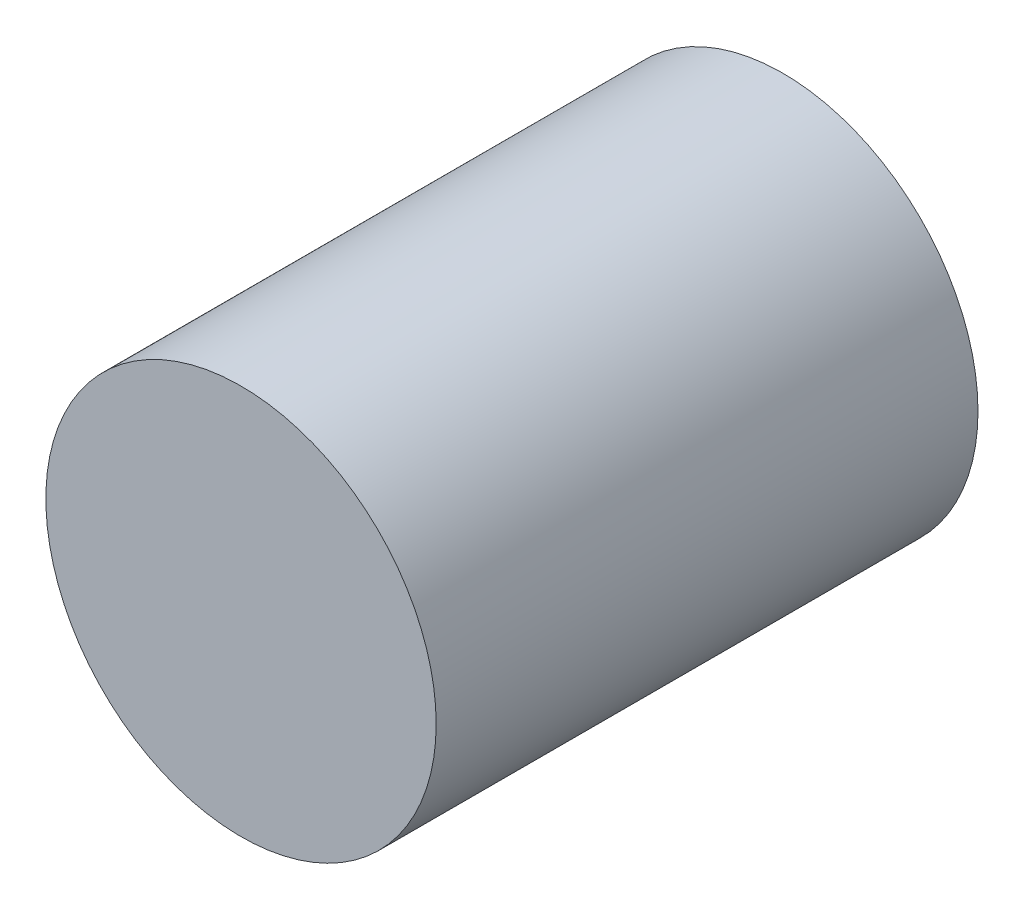
ISO-10303-21;
HEADER;
FILE_DESCRIPTION(('STEP AP214'),'2;1');
FILE_NAME('part.step','',(''),(''),'','','');
FILE_SCHEMA(('AUTOMOTIVE_DESIGN { 1 0 10303 214 1 1 1 1 }'));
ENDSEC;
DATA;
#1=APPLICATION_CONTEXT('core data for automotive mechanical design processes');
#2=APPLICATION_PROTOCOL_DEFINITION('international standard','automotive_design',2000,#1);
#3=PRODUCT_CONTEXT('',#1,'mechanical');
#4=PRODUCT('Part','Part','',(#3));
#5=PRODUCT_RELATED_PRODUCT_CATEGORY('part','',(#4));
#6=PRODUCT_DEFINITION_FORMATION('','',#4);
#7=PRODUCT_DEFINITION_CONTEXT('part definition',#1,'design');
#8=PRODUCT_DEFINITION('design','',#6,#7);
#9=PRODUCT_DEFINITION_SHAPE('','',#8);
#10=(LENGTH_UNIT() NAMED_UNIT(*) SI_UNIT(.MILLI.,.METRE.));
#11=(NAMED_UNIT(*) PLANE_ANGLE_UNIT() SI_UNIT($,.RADIAN.));
#12=(NAMED_UNIT(*) SI_UNIT($,.STERADIAN.) SOLID_ANGLE_UNIT());
#13=UNCERTAINTY_MEASURE_WITH_UNIT(LENGTH_MEASURE(1.E-05),#10,'distance_accuracy_value','');
#14=(GEOMETRIC_REPRESENTATION_CONTEXT(3) GLOBAL_UNCERTAINTY_ASSIGNED_CONTEXT((#13)) GLOBAL_UNIT_ASSIGNED_CONTEXT((#10,
#11,#12)) REPRESENTATION_CONTEXT('',''));
#15=CARTESIAN_POINT('',(0.,0.,0.));
#16=DIRECTION('',(0.,0.,1.));
#17=DIRECTION('',(1.,0.,0.));
#18=AXIS2_PLACEMENT_3D('',#15,#16,#17);
#19=CARTESIAN_POINT('',(0.,0.,52.75));
#20=DIRECTION('',(0.,0.,-1.));
#21=DIRECTION('',(-1.,0.,0.));
#22=AXIS2_PLACEMENT_3D('',#19,#20,#21);
#23=CYLINDRICAL_SURFACE('',#22,19.);
#24=CARTESIAN_POINT('',(0.,0.,52.75));
#25=DIRECTION('',(0.,0.,1.));
#26=DIRECTION('',(1.,0.,0.));
#27=AXIS2_PLACEMENT_3D('',#24,#25,#26);
#28=CIRCLE('',#27,19.);
#29=CARTESIAN_POINT('',(19.,0.,52.75));
#30=VERTEX_POINT('',#29);
#31=EDGE_CURVE('E10',#30,#30,#28,.T.);
#32=ORIENTED_EDGE('',*,*,#31,.F.);
#33=EDGE_LOOP('',(#32));
#34=FACE_BOUND('',#33,.T.);
#35=CARTESIAN_POINT('',(0.,0.,0.));
#36=DIRECTION('',(0.,0.,1.));
#37=DIRECTION('',(1.,0.,0.));
#38=AXIS2_PLACEMENT_3D('',#35,#36,#37);
#39=CIRCLE('',#38,19.);
#40=CARTESIAN_POINT('',(19.,0.,0.));
#41=VERTEX_POINT('',#40);
#42=EDGE_CURVE('E36',#41,#41,#39,.T.);
#43=ORIENTED_EDGE('',*,*,#42,.T.);
#44=EDGE_LOOP('',(#43));
#45=FACE_BOUND('',#44,.T.);
#46=ADVANCED_FACE('F33',(#34,#45),#23,.T.);
#47=CARTESIAN_POINT('',(0.,0.,52.75));
#48=DIRECTION('',(0.,0.,1.));
#49=DIRECTION('',(1.,0.,0.));
#50=AXIS2_PLACEMENT_3D('',#47,#48,#49);
#51=PLANE('',#50);
#52=ORIENTED_EDGE('',*,*,#31,.T.);
#53=EDGE_LOOP('',(#52));
#54=FACE_BOUND('',#53,.T.);
#55=ADVANCED_FACE('F48',(#54),#51,.T.);
#56=CARTESIAN_POINT('',(0.,0.,0.));
#57=DIRECTION('',(0.,0.,1.));
#58=DIRECTION('',(1.,0.,0.));
#59=AXIS2_PLACEMENT_3D('',#56,#57,#58);
#60=PLANE('',#59);
#61=ORIENTED_EDGE('',*,*,#42,.F.);
#62=EDGE_LOOP('',(#61));
#63=FACE_BOUND('',#62,.T.);
#64=ADVANCED_FACE('F46',(#63),#60,.F.);
#65=CLOSED_SHELL('',(#46,#55,#64));
#66=MANIFOLD_SOLID_BREP('B2',#65);
#67=ADVANCED_BREP_SHAPE_REPRESENTATION('',(#18,#66),#14);
#68=SHAPE_DEFINITION_REPRESENTATION(#9,#67);
ENDSEC;
END-ISO-10303-21;
